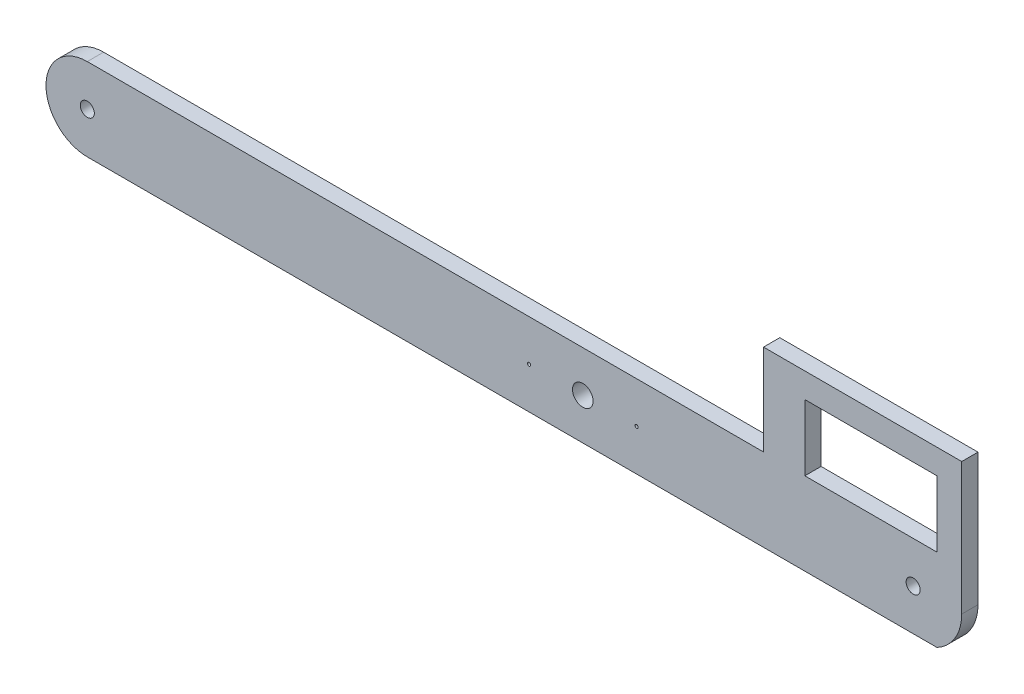
ISO-10303-21;
HEADER;
FILE_DESCRIPTION(('STEP AP214'),'2;1');
FILE_NAME('part.step','',(''),(''),'','','');
FILE_SCHEMA(('AUTOMOTIVE_DESIGN { 1 0 10303 214 1 1 1 1 }'));
ENDSEC;
DATA;
#1=APPLICATION_CONTEXT('core data for automotive mechanical design processes');
#2=APPLICATION_PROTOCOL_DEFINITION('international standard','automotive_design',2000,#1);
#3=PRODUCT_CONTEXT('',#1,'mechanical');
#4=PRODUCT('Part','Part','',(#3));
#5=PRODUCT_RELATED_PRODUCT_CATEGORY('part','',(#4));
#6=PRODUCT_DEFINITION_FORMATION('','',#4);
#7=PRODUCT_DEFINITION_CONTEXT('part definition',#1,'design');
#8=PRODUCT_DEFINITION('design','',#6,#7);
#9=PRODUCT_DEFINITION_SHAPE('','',#8);
#10=(LENGTH_UNIT() NAMED_UNIT(*) SI_UNIT(.MILLI.,.METRE.));
#11=(NAMED_UNIT(*) PLANE_ANGLE_UNIT() SI_UNIT($,.RADIAN.));
#12=(NAMED_UNIT(*) SI_UNIT($,.STERADIAN.) SOLID_ANGLE_UNIT());
#13=UNCERTAINTY_MEASURE_WITH_UNIT(LENGTH_MEASURE(1.E-05),#10,'distance_accuracy_value','');
#14=(GEOMETRIC_REPRESENTATION_CONTEXT(3) GLOBAL_UNCERTAINTY_ASSIGNED_CONTEXT((#13)) GLOBAL_UNIT_ASSIGNED_CONTEXT((#10,
#11,#12)) REPRESENTATION_CONTEXT('',''));
#15=CARTESIAN_POINT('',(0.,0.,0.));
#16=DIRECTION('',(0.,0.,1.));
#17=DIRECTION('',(1.,0.,0.));
#18=AXIS2_PLACEMENT_3D('',#15,#16,#17);
#19=CARTESIAN_POINT('',(108.923032041449,0.,5.0038));
#20=DIRECTION('',(-1.,0.,0.));
#21=DIRECTION('',(0.,-1.,0.));
#22=AXIS2_PLACEMENT_3D('',#19,#20,#21);
#23=PLANE('',#22);
#24=DIRECTION('',(0.,1.,0.));
#25=VECTOR('',#24,1.);
#26=CARTESIAN_POINT('',(108.923032041449,0.,0.));
#27=LINE('',#26,#25);
#28=CARTESIAN_POINT('',(108.923032041449,12.7,0.));
#29=VERTEX_POINT('',#28);
#30=CARTESIAN_POINT('',(108.923032041449,33.0200000000001,0.));
#31=VERTEX_POINT('',#30);
#32=EDGE_CURVE('E341',#29,#31,#27,.T.);
#33=ORIENTED_EDGE('',*,*,#32,.F.);
#34=DIRECTION('',(0.,0.,-1.));
#35=VECTOR('',#34,1.);
#36=CARTESIAN_POINT('',(108.923032041449,12.7,5.0038));
#37=LINE('',#36,#35);
#38=CARTESIAN_POINT('',(108.923032041449,12.7,5.0038));
#39=VERTEX_POINT('',#38);
#40=EDGE_CURVE('E12',#39,#29,#37,.T.);
#41=ORIENTED_EDGE('',*,*,#40,.F.);
#42=DIRECTION('',(0.,1.,0.));
#43=VECTOR('',#42,1.);
#44=CARTESIAN_POINT('',(108.923032041449,0.,5.0038));
#45=LINE('',#44,#43);
#46=CARTESIAN_POINT('',(108.923032041449,33.0200000000001,5.0038));
#47=VERTEX_POINT('',#46);
#48=EDGE_CURVE('E159',#39,#47,#45,.T.);
#49=ORIENTED_EDGE('',*,*,#48,.T.);
#50=DIRECTION('',(0.,0.,-1.));
#51=VECTOR('',#50,1.);
#52=CARTESIAN_POINT('',(108.923032041449,33.0200000000001,5.0038));
#53=LINE('',#52,#51);
#54=EDGE_CURVE('E108',#47,#31,#53,.T.);
#55=ORIENTED_EDGE('',*,*,#54,.T.);
#56=EDGE_LOOP('',(#33,#41,#49,#55));
#57=FACE_BOUND('',#56,.T.);
#58=ADVANCED_FACE('F44',(#57),#23,.T.);
#59=CARTESIAN_POINT('',(0.,12.7,5.0038));
#60=DIRECTION('',(0.,1.,0.));
#61=DIRECTION('',(-1.,0.,0.));
#62=AXIS2_PLACEMENT_3D('',#59,#60,#61);
#63=PLANE('',#62);
#64=DIRECTION('',(1.,0.,0.));
#65=VECTOR('',#64,1.);
#66=CARTESIAN_POINT('',(0.,12.7,0.));
#67=LINE('',#66,#65);
#68=CARTESIAN_POINT('',(68.2830320414487,12.7,0.));
#69=VERTEX_POINT('',#68);
#70=EDGE_CURVE('E146',#69,#29,#67,.T.);
#71=ORIENTED_EDGE('',*,*,#70,.F.);
#72=DIRECTION('',(0.,0.,-1.));
#73=VECTOR('',#72,1.);
#74=CARTESIAN_POINT('',(68.2830320414487,12.7,5.0038));
#75=LINE('',#74,#73);
#76=CARTESIAN_POINT('',(68.2830320414487,12.7,5.0038));
#77=VERTEX_POINT('',#76);
#78=EDGE_CURVE('E55',#77,#69,#75,.T.);
#79=ORIENTED_EDGE('',*,*,#78,.F.);
#80=DIRECTION('',(1.,0.,0.));
#81=VECTOR('',#80,1.);
#82=CARTESIAN_POINT('',(0.,12.7,5.0038));
#83=LINE('',#82,#81);
#84=EDGE_CURVE('E144',#77,#39,#83,.T.);
#85=ORIENTED_EDGE('',*,*,#84,.T.);
#86=ORIENTED_EDGE('',*,*,#40,.T.);
#87=EDGE_LOOP('',(#71,#79,#85,#86));
#88=FACE_BOUND('',#87,.T.);
#89=ADVANCED_FACE('F142',(#88),#63,.T.);
#90=CARTESIAN_POINT('',(68.2830320414487,0.,5.0038));
#91=DIRECTION('',(-1.,0.,0.));
#92=DIRECTION('',(0.,0.,1.));
#93=AXIS2_PLACEMENT_3D('',#90,#91,#92);
#94=PLANE('',#93);
#95=DIRECTION('',(0.,1.,0.));
#96=VECTOR('',#95,1.);
#97=CARTESIAN_POINT('',(68.2830320414487,0.,0.));
#98=LINE('',#97,#96);
#99=CARTESIAN_POINT('',(68.2830320414487,33.02,0.));
#100=VERTEX_POINT('',#99);
#101=EDGE_CURVE('E346',#69,#100,#98,.T.);
#102=ORIENTED_EDGE('',*,*,#101,.T.);
#103=DIRECTION('',(0.,0.,-1.));
#104=VECTOR('',#103,1.);
#105=CARTESIAN_POINT('',(68.2830320414487,33.02,5.0038));
#106=LINE('',#105,#104);
#107=CARTESIAN_POINT('',(68.2830320414487,33.02,5.0038));
#108=VERTEX_POINT('',#107);
#109=EDGE_CURVE('E150',#108,#100,#106,.T.);
#110=ORIENTED_EDGE('',*,*,#109,.F.);
#111=DIRECTION('',(0.,1.,0.));
#112=VECTOR('',#111,1.);
#113=CARTESIAN_POINT('',(68.2830320414487,0.,5.0038));
#114=LINE('',#113,#112);
#115=EDGE_CURVE('E153',#77,#108,#114,.T.);
#116=ORIENTED_EDGE('',*,*,#115,.F.);
#117=ORIENTED_EDGE('',*,*,#78,.T.);
#118=EDGE_LOOP('',(#102,#110,#116,#117));
#119=FACE_BOUND('',#118,.T.);
#120=ADVANCED_FACE('F154',(#119),#94,.F.);
#121=CARTESIAN_POINT('',(102.149698708115,0.,5.0038));
#122=DIRECTION('',(0.,0.,-1.));
#123=DIRECTION('',(-1.,0.,0.));
#124=AXIS2_PLACEMENT_3D('',#121,#122,#123);
#125=CYLINDRICAL_SURFACE('',#124,14.3933333333334);
#126=CARTESIAN_POINT('',(102.149698708115,0.,0.));
#127=DIRECTION('',(0.,0.,1.));
#128=DIRECTION('',(1.,0.,0.));
#129=AXIS2_PLACEMENT_3D('',#126,#127,#128);
#130=CIRCLE('',#129,14.3933333333334);
#131=CARTESIAN_POINT('',(108.923032041449,-12.7,0.));
#132=VERTEX_POINT('',#131);
#133=CARTESIAN_POINT('',(116.543032041449,0.,0.));
#134=VERTEX_POINT('',#133);
#135=EDGE_CURVE('E200',#132,#134,#130,.T.);
#136=ORIENTED_EDGE('',*,*,#135,.T.);
#137=DIRECTION('',(0.,0.,-1.));
#138=VECTOR('',#137,1.);
#139=CARTESIAN_POINT('',(116.543032041449,0.,5.0038));
#140=LINE('',#139,#138);
#141=CARTESIAN_POINT('',(116.543032041449,0.,5.0038));
#142=VERTEX_POINT('',#141);
#143=EDGE_CURVE('E48',#142,#134,#140,.T.);
#144=ORIENTED_EDGE('',*,*,#143,.F.);
#145=CARTESIAN_POINT('',(102.149698708115,0.,5.0038));
#146=DIRECTION('',(0.,0.,1.));
#147=DIRECTION('',(1.,0.,0.));
#148=AXIS2_PLACEMENT_3D('',#145,#146,#147);
#149=CIRCLE('',#148,14.3933333333334);
#150=CARTESIAN_POINT('',(108.923032041449,-12.7,5.0038));
#151=VERTEX_POINT('',#150);
#152=EDGE_CURVE('E187',#151,#142,#149,.T.);
#153=ORIENTED_EDGE('',*,*,#152,.F.);
#154=DIRECTION('',(0.,0.,-1.));
#155=VECTOR('',#154,1.);
#156=CARTESIAN_POINT('',(108.923032041449,-12.7,5.0038));
#157=LINE('',#156,#155);
#158=EDGE_CURVE('E360',#151,#132,#157,.T.);
#159=ORIENTED_EDGE('',*,*,#158,.T.);
#160=EDGE_LOOP('',(#136,#144,#153,#159));
#161=FACE_BOUND('',#160,.T.);
#162=ADVANCED_FACE('F46',(#161),#125,.T.);
#163=CARTESIAN_POINT('',(116.543032041449,0.,5.0038));
#164=DIRECTION('',(-1.,0.,0.));
#165=DIRECTION('',(0.,0.,1.));
#166=AXIS2_PLACEMENT_3D('',#163,#164,#165);
#167=PLANE('',#166);
#168=DIRECTION('',(0.,1.,0.));
#169=VECTOR('',#168,1.);
#170=CARTESIAN_POINT('',(116.543032041449,0.,0.));
#171=LINE('',#170,#169);
#172=CARTESIAN_POINT('',(116.543032041449,40.64,0.));
#173=VERTEX_POINT('',#172);
#174=EDGE_CURVE('E231',#134,#173,#171,.T.);
#175=ORIENTED_EDGE('',*,*,#174,.T.);
#176=DIRECTION('',(0.,0.,-1.));
#177=VECTOR('',#176,1.);
#178=CARTESIAN_POINT('',(116.543032041449,40.64,5.0038));
#179=LINE('',#178,#177);
#180=CARTESIAN_POINT('',(116.543032041449,40.64,5.0038));
#181=VERTEX_POINT('',#180);
#182=EDGE_CURVE('E319',#181,#173,#179,.T.);
#183=ORIENTED_EDGE('',*,*,#182,.F.);
#184=DIRECTION('',(0.,1.,0.));
#185=VECTOR('',#184,1.);
#186=CARTESIAN_POINT('',(116.543032041449,0.,5.0038));
#187=LINE('',#186,#185);
#188=EDGE_CURVE('E116',#142,#181,#187,.T.);
#189=ORIENTED_EDGE('',*,*,#188,.F.);
#190=ORIENTED_EDGE('',*,*,#143,.T.);
#191=EDGE_LOOP('',(#175,#183,#189,#190));
#192=FACE_BOUND('',#191,.T.);
#193=ADVANCED_FACE('F311',(#192),#167,.F.);
#194=CARTESIAN_POINT('',(0.,40.64,5.0038));
#195=DIRECTION('',(0.,-1.,0.));
#196=DIRECTION('',(0.,0.,-1.));
#197=AXIS2_PLACEMENT_3D('',#194,#195,#196);
#198=PLANE('',#197);
#199=DIRECTION('',(-1.,0.,0.));
#200=VECTOR('',#199,1.);
#201=CARTESIAN_POINT('',(0.,40.64,0.));
#202=LINE('',#201,#200);
#203=CARTESIAN_POINT('',(55.5830320414487,40.64,0.));
#204=VERTEX_POINT('',#203);
#205=EDGE_CURVE('E227',#173,#204,#202,.T.);
#206=ORIENTED_EDGE('',*,*,#205,.T.);
#207=DIRECTION('',(0.,0.,-1.));
#208=VECTOR('',#207,1.);
#209=CARTESIAN_POINT('',(55.5830320414487,40.64,5.0038));
#210=LINE('',#209,#208);
#211=CARTESIAN_POINT('',(55.5830320414487,40.64,5.0038));
#212=VERTEX_POINT('',#211);
#213=EDGE_CURVE('E328',#212,#204,#210,.T.);
#214=ORIENTED_EDGE('',*,*,#213,.F.);
#215=DIRECTION('',(-1.,0.,0.));
#216=VECTOR('',#215,1.);
#217=CARTESIAN_POINT('',(0.,40.64,5.0038));
#218=LINE('',#217,#216);
#219=EDGE_CURVE('E179',#181,#212,#218,.T.);
#220=ORIENTED_EDGE('',*,*,#219,.F.);
#221=ORIENTED_EDGE('',*,*,#182,.T.);
#222=EDGE_LOOP('',(#206,#214,#220,#221));
#223=FACE_BOUND('',#222,.T.);
#224=ADVANCED_FACE('F309',(#223),#198,.F.);
#225=CARTESIAN_POINT('',(55.5830320414487,0.,5.0038));
#226=DIRECTION('',(-1.,0.,0.));
#227=DIRECTION('',(0.,0.,1.));
#228=AXIS2_PLACEMENT_3D('',#225,#226,#227);
#229=PLANE('',#228);
#230=DIRECTION('',(0.,1.,0.));
#231=VECTOR('',#230,1.);
#232=CARTESIAN_POINT('',(55.5830320414487,0.,0.));
#233=LINE('',#232,#231);
#234=CARTESIAN_POINT('',(55.5830320414487,12.7,0.));
#235=VERTEX_POINT('',#234);
#236=EDGE_CURVE('E214',#235,#204,#233,.T.);
#237=ORIENTED_EDGE('',*,*,#236,.F.);
#238=DIRECTION('',(0.,0.,-1.));
#239=VECTOR('',#238,1.);
#240=CARTESIAN_POINT('',(55.5830320414487,12.7,5.0038));
#241=LINE('',#240,#239);
#242=CARTESIAN_POINT('',(55.5830320414487,12.7,5.0038));
#243=VERTEX_POINT('',#242);
#244=EDGE_CURVE('E370',#243,#235,#241,.T.);
#245=ORIENTED_EDGE('',*,*,#244,.F.);
#246=DIRECTION('',(0.,1.,0.));
#247=VECTOR('',#246,1.);
#248=CARTESIAN_POINT('',(55.5830320414487,0.,5.0038));
#249=LINE('',#248,#247);
#250=EDGE_CURVE('E171',#243,#212,#249,.T.);
#251=ORIENTED_EDGE('',*,*,#250,.T.);
#252=ORIENTED_EDGE('',*,*,#213,.T.);
#253=EDGE_LOOP('',(#237,#245,#251,#252));
#254=FACE_BOUND('',#253,.T.);
#255=ADVANCED_FACE('F306',(#254),#229,.T.);
#256=CARTESIAN_POINT('',(-152.4,12.7,0.));
#257=VERTEX_POINT('',#256);
#258=EDGE_CURVE('E207',#257,#235,#67,.T.);
#259=ORIENTED_EDGE('',*,*,#258,.F.);
#260=DIRECTION('',(0.,0.,-1.));
#261=VECTOR('',#260,1.);
#262=CARTESIAN_POINT('',(-152.4,12.7,5.0038));
#263=LINE('',#262,#261);
#264=CARTESIAN_POINT('',(-152.4,12.7,5.0038));
#265=VERTEX_POINT('',#264);
#266=EDGE_CURVE('E367',#265,#257,#263,.T.);
#267=ORIENTED_EDGE('',*,*,#266,.F.);
#268=EDGE_CURVE('E162',#265,#243,#83,.T.);
#269=ORIENTED_EDGE('',*,*,#268,.T.);
#270=ORIENTED_EDGE('',*,*,#244,.T.);
#271=EDGE_LOOP('',(#259,#267,#269,#270));
#272=FACE_BOUND('',#271,.T.);
#273=ADVANCED_FACE('F292',(#272),#63,.T.);
#274=CARTESIAN_POINT('',(-152.4,0.,5.0038));
#275=DIRECTION('',(0.,0.,-1.));
#276=DIRECTION('',(-1.,0.,0.));
#277=AXIS2_PLACEMENT_3D('',#274,#275,#276);
#278=CYLINDRICAL_SURFACE('',#277,12.7);
#279=CARTESIAN_POINT('',(-152.4,0.,0.));
#280=DIRECTION('',(0.,0.,1.));
#281=DIRECTION('',(1.,0.,0.));
#282=AXIS2_PLACEMENT_3D('',#279,#280,#281);
#283=CIRCLE('',#282,12.7);
#284=CARTESIAN_POINT('',(-152.4,-12.7,0.));
#285=VERTEX_POINT('',#284);
#286=EDGE_CURVE('E213',#285,#257,#283,.F.);
#287=ORIENTED_EDGE('',*,*,#286,.F.);
#288=DIRECTION('',(0.,0.,-1.));
#289=VECTOR('',#288,1.);
#290=CARTESIAN_POINT('',(-152.4,-12.7,5.0038));
#291=LINE('',#290,#289);
#292=CARTESIAN_POINT('',(-152.4,-12.7,5.0038));
#293=VERTEX_POINT('',#292);
#294=EDGE_CURVE('E364',#293,#285,#291,.T.);
#295=ORIENTED_EDGE('',*,*,#294,.F.);
#296=CARTESIAN_POINT('',(-152.4,0.,5.0038));
#297=DIRECTION('',(0.,0.,1.));
#298=DIRECTION('',(1.,0.,0.));
#299=AXIS2_PLACEMENT_3D('',#296,#297,#298);
#300=CIRCLE('',#299,12.7);
#301=EDGE_CURVE('E170',#293,#265,#300,.F.);
#302=ORIENTED_EDGE('',*,*,#301,.T.);
#303=ORIENTED_EDGE('',*,*,#266,.T.);
#304=EDGE_LOOP('',(#287,#295,#302,#303));
#305=FACE_BOUND('',#304,.T.);
#306=ADVANCED_FACE('F298',(#305),#278,.T.);
#307=CARTESIAN_POINT('',(0.,0.,5.0038));
#308=DIRECTION('',(0.,0.,-1.));
#309=DIRECTION('',(-1.,0.,0.));
#310=AXIS2_PLACEMENT_3D('',#307,#308,#309);
#311=CYLINDRICAL_SURFACE('',#310,3.175);
#312=CARTESIAN_POINT('',(0.,0.,5.0038));
#313=DIRECTION('',(0.,0.,1.));
#314=DIRECTION('',(1.,0.,0.));
#315=AXIS2_PLACEMENT_3D('',#312,#313,#314);
#316=CIRCLE('',#315,3.175);
#317=CARTESIAN_POINT('',(3.175,0.,5.0038));
#318=VERTEX_POINT('',#317);
#319=EDGE_CURVE('E164',#318,#318,#316,.T.);
#320=ORIENTED_EDGE('',*,*,#319,.T.);
#321=EDGE_LOOP('',(#320));
#322=FACE_BOUND('',#321,.T.);
#323=CARTESIAN_POINT('',(0.,0.,0.));
#324=DIRECTION('',(0.,0.,1.));
#325=DIRECTION('',(1.,0.,0.));
#326=AXIS2_PLACEMENT_3D('',#323,#324,#325);
#327=CIRCLE('',#326,3.175);
#328=CARTESIAN_POINT('',(3.175,0.,0.));
#329=VERTEX_POINT('',#328);
#330=EDGE_CURVE('E338',#329,#329,#327,.T.);
#331=ORIENTED_EDGE('',*,*,#330,.F.);
#332=EDGE_LOOP('',(#331));
#333=FACE_BOUND('',#332,.T.);
#334=ADVANCED_FACE('F295',(#322,#333),#311,.F.);
#335=CARTESIAN_POINT('',(0.,-12.7,5.0038));
#336=DIRECTION('',(0.,1.,0.));
#337=DIRECTION('',(0.,0.,1.));
#338=AXIS2_PLACEMENT_3D('',#335,#336,#337);
#339=PLANE('',#338);
#340=DIRECTION('',(1.,0.,0.));
#341=VECTOR('',#340,1.);
#342=CARTESIAN_POINT('',(0.,-12.7,0.));
#343=LINE('',#342,#341);
#344=EDGE_CURVE('E336',#285,#132,#343,.T.);
#345=ORIENTED_EDGE('',*,*,#344,.T.);
#346=ORIENTED_EDGE('',*,*,#158,.F.);
#347=DIRECTION('',(1.,0.,0.));
#348=VECTOR('',#347,1.);
#349=CARTESIAN_POINT('',(0.,-12.7,5.0038));
#350=LINE('',#349,#348);
#351=EDGE_CURVE('E177',#293,#151,#350,.T.);
#352=ORIENTED_EDGE('',*,*,#351,.F.);
#353=ORIENTED_EDGE('',*,*,#294,.T.);
#354=EDGE_LOOP('',(#345,#346,#352,#353));
#355=FACE_BOUND('',#354,.T.);
#356=ADVANCED_FACE('F280',(#355),#339,.F.);
#357=CARTESIAN_POINT('',(0.,33.0199999999999,5.0038));
#358=DIRECTION('',(0.,1.,0.));
#359=DIRECTION('',(-1.,0.,0.));
#360=AXIS2_PLACEMENT_3D('',#357,#358,#359);
#361=PLANE('',#360);
#362=DIRECTION('',(1.,0.,0.));
#363=VECTOR('',#362,1.);
#364=CARTESIAN_POINT('',(0.,33.0199999999999,0.));
#365=LINE('',#364,#363);
#366=EDGE_CURVE('E101',#100,#31,#365,.T.);
#367=ORIENTED_EDGE('',*,*,#366,.T.);
#368=ORIENTED_EDGE('',*,*,#54,.F.);
#369=DIRECTION('',(1.,0.,0.));
#370=VECTOR('',#369,1.);
#371=CARTESIAN_POINT('',(0.,33.0199999999999,5.0038));
#372=LINE('',#371,#370);
#373=EDGE_CURVE('E64',#108,#47,#372,.T.);
#374=ORIENTED_EDGE('',*,*,#373,.F.);
#375=ORIENTED_EDGE('',*,*,#109,.T.);
#376=EDGE_LOOP('',(#367,#368,#374,#375));
#377=FACE_BOUND('',#376,.T.);
#378=ADVANCED_FACE('F270',(#377),#361,.F.);
#379=CARTESIAN_POINT('',(0.,0.,5.0038));
#380=DIRECTION('',(0.,0.,1.));
#381=DIRECTION('',(1.,0.,0.));
#382=AXIS2_PLACEMENT_3D('',#379,#380,#381);
#383=PLANE('',#382);
#384=CARTESIAN_POINT('',(-16.5354,0.,5.0038));
#385=DIRECTION('',(0.,0.,1.));
#386=DIRECTION('',(1.,0.,0.));
#387=AXIS2_PLACEMENT_3D('',#384,#385,#386);
#388=CIRCLE('',#387,0.500000270000001);
#389=CARTESIAN_POINT('',(-16.03539973,0.,5.0038));
#390=VERTEX_POINT('',#389);
#391=EDGE_CURVE('E254',#390,#390,#388,.T.);
#392=ORIENTED_EDGE('',*,*,#391,.F.);
#393=EDGE_LOOP('',(#392));
#394=FACE_BOUND('',#393,.T.);
#395=CARTESIAN_POINT('',(16.5354,0.,5.0038));
#396=DIRECTION('',(0.,0.,1.));
#397=DIRECTION('',(1.,0.,0.));
#398=AXIS2_PLACEMENT_3D('',#395,#396,#397);
#399=CIRCLE('',#398,0.500000270000001);
#400=CARTESIAN_POINT('',(17.03540027,0.,5.0038));
#401=VERTEX_POINT('',#400);
#402=EDGE_CURVE('E250',#401,#401,#399,.T.);
#403=ORIENTED_EDGE('',*,*,#402,.F.);
#404=EDGE_LOOP('',(#403));
#405=FACE_BOUND('',#404,.T.);
#406=ORIENTED_EDGE('',*,*,#152,.T.);
#407=ORIENTED_EDGE('',*,*,#188,.T.);
#408=ORIENTED_EDGE('',*,*,#219,.T.);
#409=ORIENTED_EDGE('',*,*,#250,.F.);
#410=ORIENTED_EDGE('',*,*,#268,.F.);
#411=ORIENTED_EDGE('',*,*,#301,.F.);
#412=ORIENTED_EDGE('',*,*,#351,.T.);
#413=EDGE_LOOP('',(#406,#407,#408,#409,#410,#411,#412));
#414=FACE_BOUND('',#413,.T.);
#415=ORIENTED_EDGE('',*,*,#319,.F.);
#416=EDGE_LOOP('',(#415));
#417=FACE_BOUND('',#416,.T.);
#418=ORIENTED_EDGE('',*,*,#48,.F.);
#419=ORIENTED_EDGE('',*,*,#84,.F.);
#420=ORIENTED_EDGE('',*,*,#115,.T.);
#421=ORIENTED_EDGE('',*,*,#373,.T.);
#422=EDGE_LOOP('',(#418,#419,#420,#421));
#423=FACE_BOUND('',#422,.T.);
#424=CARTESIAN_POINT('',(-152.4,0.,5.0038));
#425=DIRECTION('',(0.,0.,1.));
#426=DIRECTION('',(1.,0.,0.));
#427=AXIS2_PLACEMENT_3D('',#424,#425,#426);
#428=CIRCLE('',#427,2.15899999999999);
#429=CARTESIAN_POINT('',(-150.241,0.,5.0038));
#430=VERTEX_POINT('',#429);
#431=EDGE_CURVE('E190',#430,#430,#428,.T.);
#432=ORIENTED_EDGE('',*,*,#431,.F.);
#433=EDGE_LOOP('',(#432));
#434=FACE_BOUND('',#433,.T.);
#435=CARTESIAN_POINT('',(101.6,0.,5.0038));
#436=DIRECTION('',(0.,0.,1.));
#437=DIRECTION('',(1.,0.,0.));
#438=AXIS2_PLACEMENT_3D('',#435,#436,#437);
#439=CIRCLE('',#438,2.15899999999999);
#440=CARTESIAN_POINT('',(103.759,0.,5.0038));
#441=VERTEX_POINT('',#440);
#442=EDGE_CURVE('E201',#441,#441,#439,.T.);
#443=ORIENTED_EDGE('',*,*,#442,.F.);
#444=EDGE_LOOP('',(#443));
#445=FACE_BOUND('',#444,.T.);
#446=ADVANCED_FACE('F157',(#394,#405,#414,#417,#423,#434,#445),#383,.T.);
#447=CARTESIAN_POINT('',(0.,0.,0.));
#448=DIRECTION('',(0.,0.,1.));
#449=DIRECTION('',(1.,0.,0.));
#450=AXIS2_PLACEMENT_3D('',#447,#448,#449);
#451=PLANE('',#450);
#452=CARTESIAN_POINT('',(-16.5354,0.,0.));
#453=DIRECTION('',(0.,0.,-1.));
#454=DIRECTION('',(-1.,0.,0.));
#455=AXIS2_PLACEMENT_3D('',#452,#453,#454);
#456=CIRCLE('',#455,0.500000270000001);
#457=CARTESIAN_POINT('',(-17.03540027,0.,0.));
#458=VERTEX_POINT('',#457);
#459=EDGE_CURVE('E248',#458,#458,#456,.T.);
#460=ORIENTED_EDGE('',*,*,#459,.F.);
#461=EDGE_LOOP('',(#460));
#462=FACE_BOUND('',#461,.T.);
#463=CARTESIAN_POINT('',(16.5354,0.,0.));
#464=DIRECTION('',(0.,0.,-1.));
#465=DIRECTION('',(-1.,0.,0.));
#466=AXIS2_PLACEMENT_3D('',#463,#464,#465);
#467=CIRCLE('',#466,0.500000270000001);
#468=CARTESIAN_POINT('',(16.03539973,0.,0.));
#469=VERTEX_POINT('',#468);
#470=EDGE_CURVE('E243',#469,#469,#467,.T.);
#471=ORIENTED_EDGE('',*,*,#470,.F.);
#472=EDGE_LOOP('',(#471));
#473=FACE_BOUND('',#472,.T.);
#474=ORIENTED_EDGE('',*,*,#135,.F.);
#475=ORIENTED_EDGE('',*,*,#344,.F.);
#476=ORIENTED_EDGE('',*,*,#286,.T.);
#477=ORIENTED_EDGE('',*,*,#258,.T.);
#478=ORIENTED_EDGE('',*,*,#236,.T.);
#479=ORIENTED_EDGE('',*,*,#205,.F.);
#480=ORIENTED_EDGE('',*,*,#174,.F.);
#481=EDGE_LOOP('',(#474,#475,#476,#477,#478,#479,#480));
#482=FACE_BOUND('',#481,.T.);
#483=ORIENTED_EDGE('',*,*,#330,.T.);
#484=EDGE_LOOP('',(#483));
#485=FACE_BOUND('',#484,.T.);
#486=ORIENTED_EDGE('',*,*,#32,.T.);
#487=ORIENTED_EDGE('',*,*,#366,.F.);
#488=ORIENTED_EDGE('',*,*,#101,.F.);
#489=ORIENTED_EDGE('',*,*,#70,.T.);
#490=EDGE_LOOP('',(#486,#487,#488,#489));
#491=FACE_BOUND('',#490,.T.);
#492=CARTESIAN_POINT('',(-152.4,0.,0.));
#493=DIRECTION('',(0.,0.,1.));
#494=DIRECTION('',(1.,0.,0.));
#495=AXIS2_PLACEMENT_3D('',#492,#493,#494);
#496=CIRCLE('',#495,2.15899999999999);
#497=CARTESIAN_POINT('',(-150.241,0.,0.));
#498=VERTEX_POINT('',#497);
#499=EDGE_CURVE('E194',#498,#498,#496,.T.);
#500=ORIENTED_EDGE('',*,*,#499,.T.);
#501=EDGE_LOOP('',(#500));
#502=FACE_BOUND('',#501,.T.);
#503=CARTESIAN_POINT('',(101.6,0.,0.));
#504=DIRECTION('',(0.,0.,1.));
#505=DIRECTION('',(1.,0.,0.));
#506=AXIS2_PLACEMENT_3D('',#503,#504,#505);
#507=CIRCLE('',#506,2.15899999999999);
#508=CARTESIAN_POINT('',(103.759,0.,0.));
#509=VERTEX_POINT('',#508);
#510=EDGE_CURVE('E195',#509,#509,#507,.T.);
#511=ORIENTED_EDGE('',*,*,#510,.T.);
#512=EDGE_LOOP('',(#511));
#513=FACE_BOUND('',#512,.T.);
#514=ADVANCED_FACE('F269',(#462,#473,#482,#485,#491,#502,#513),#451,.F.);
#515=CARTESIAN_POINT('',(-152.4,0.,0.));
#516=DIRECTION('',(0.,0.,1.));
#517=DIRECTION('',(1.,0.,0.));
#518=AXIS2_PLACEMENT_3D('',#515,#516,#517);
#519=CYLINDRICAL_SURFACE('',#518,2.15899999999999);
#520=ORIENTED_EDGE('',*,*,#499,.F.);
#521=EDGE_LOOP('',(#520));
#522=FACE_BOUND('',#521,.T.);
#523=ORIENTED_EDGE('',*,*,#431,.T.);
#524=EDGE_LOOP('',(#523));
#525=FACE_BOUND('',#524,.T.);
#526=ADVANCED_FACE('F277',(#522,#525),#519,.F.);
#527=CARTESIAN_POINT('',(101.6,0.,0.));
#528=DIRECTION('',(0.,0.,1.));
#529=DIRECTION('',(1.,0.,0.));
#530=AXIS2_PLACEMENT_3D('',#527,#528,#529);
#531=CYLINDRICAL_SURFACE('',#530,2.15899999999999);
#532=ORIENTED_EDGE('',*,*,#510,.F.);
#533=EDGE_LOOP('',(#532));
#534=FACE_BOUND('',#533,.T.);
#535=ORIENTED_EDGE('',*,*,#442,.T.);
#536=EDGE_LOOP('',(#535));
#537=FACE_BOUND('',#536,.T.);
#538=ADVANCED_FACE('F266',(#534,#537),#531,.F.);
#539=CARTESIAN_POINT('',(16.5354,0.,19.304));
#540=DIRECTION('',(0.,0.,-1.));
#541=DIRECTION('',(-1.,0.,0.));
#542=AXIS2_PLACEMENT_3D('',#539,#540,#541);
#543=CYLINDRICAL_SURFACE('',#542,0.500000270000001);
#544=ORIENTED_EDGE('',*,*,#402,.T.);
#545=EDGE_LOOP('',(#544));
#546=FACE_BOUND('',#545,.T.);
#547=ORIENTED_EDGE('',*,*,#470,.T.);
#548=EDGE_LOOP('',(#547));
#549=FACE_BOUND('',#548,.T.);
#550=ADVANCED_FACE('F401',(#546,#549),#543,.F.);
#551=CARTESIAN_POINT('',(-16.5354,0.,19.304));
#552=DIRECTION('',(0.,0.,-1.));
#553=DIRECTION('',(-1.,0.,0.));
#554=AXIS2_PLACEMENT_3D('',#551,#552,#553);
#555=CYLINDRICAL_SURFACE('',#554,0.500000270000001);
#556=ORIENTED_EDGE('',*,*,#391,.T.);
#557=EDGE_LOOP('',(#556));
#558=FACE_BOUND('',#557,.T.);
#559=ORIENTED_EDGE('',*,*,#459,.T.);
#560=EDGE_LOOP('',(#559));
#561=FACE_BOUND('',#560,.T.);
#562=ADVANCED_FACE('F407',(#558,#561),#555,.F.);
#563=CLOSED_SHELL('',(#58,#89,#120,#162,#193,#224,#255,#273,#306,#334,#356,#378,#446,#514,#526,
#538,#550,#562));
#564=MANIFOLD_SOLID_BREP('B2',#563);
#565=ADVANCED_BREP_SHAPE_REPRESENTATION('',(#18,#564),#14);
#566=SHAPE_DEFINITION_REPRESENTATION(#9,#565);
ENDSEC;
END-ISO-10303-21;
